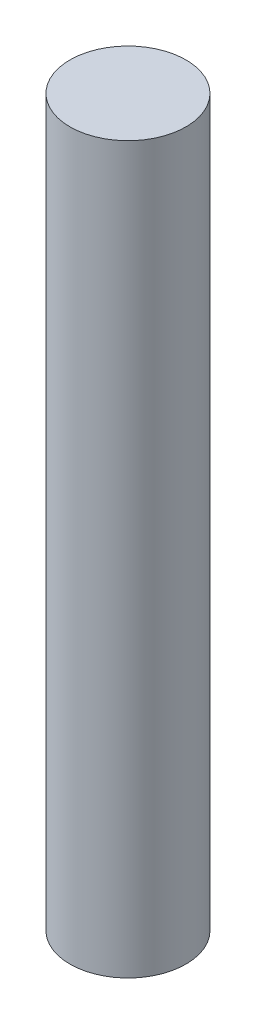
ISO-10303-21;
HEADER;
FILE_DESCRIPTION(('STEP AP214'),'2;1');
FILE_NAME('part.step','',(''),(''),'','','');
FILE_SCHEMA(('AUTOMOTIVE_DESIGN { 1 0 10303 214 1 1 1 1 }'));
ENDSEC;
DATA;
#1=APPLICATION_CONTEXT('core data for automotive mechanical design processes');
#2=APPLICATION_PROTOCOL_DEFINITION('international standard','automotive_design',2000,#1);
#3=PRODUCT_CONTEXT('',#1,'mechanical');
#4=PRODUCT('Part','Part','',(#3));
#5=PRODUCT_RELATED_PRODUCT_CATEGORY('part','',(#4));
#6=PRODUCT_DEFINITION_FORMATION('','',#4);
#7=PRODUCT_DEFINITION_CONTEXT('part definition',#1,'design');
#8=PRODUCT_DEFINITION('design','',#6,#7);
#9=PRODUCT_DEFINITION_SHAPE('','',#8);
#10=(LENGTH_UNIT() NAMED_UNIT(*) SI_UNIT(.MILLI.,.METRE.));
#11=(NAMED_UNIT(*) PLANE_ANGLE_UNIT() SI_UNIT($,.RADIAN.));
#12=(NAMED_UNIT(*) SI_UNIT($,.STERADIAN.) SOLID_ANGLE_UNIT());
#13=UNCERTAINTY_MEASURE_WITH_UNIT(LENGTH_MEASURE(1.E-05),#10,'distance_accuracy_value','');
#14=(GEOMETRIC_REPRESENTATION_CONTEXT(3) GLOBAL_UNCERTAINTY_ASSIGNED_CONTEXT((#13)) GLOBAL_UNIT_ASSIGNED_CONTEXT((#10,
#11,#12)) REPRESENTATION_CONTEXT('',''));
#15=CARTESIAN_POINT('',(0.,0.,0.));
#16=DIRECTION('',(0.,0.,1.));
#17=DIRECTION('',(1.,0.,0.));
#18=AXIS2_PLACEMENT_3D('',#15,#16,#17);
#19=CARTESIAN_POINT('',(0.,125.,0.));
#20=DIRECTION('',(0.,-1.,0.));
#21=DIRECTION('',(0.,0.,-1.));
#22=AXIS2_PLACEMENT_3D('',#19,#20,#21);
#23=CYLINDRICAL_SURFACE('',#22,10.);
#24=CARTESIAN_POINT('',(0.,125.,0.));
#25=DIRECTION('',(0.,1.,0.));
#26=DIRECTION('',(0.,0.,1.));
#27=AXIS2_PLACEMENT_3D('',#24,#25,#26);
#28=CIRCLE('',#27,10.);
#29=CARTESIAN_POINT('',(0.,125.,10.));
#30=VERTEX_POINT('',#29);
#31=EDGE_CURVE('E10',#30,#30,#28,.T.);
#32=ORIENTED_EDGE('',*,*,#31,.F.);
#33=EDGE_LOOP('',(#32));
#34=FACE_BOUND('',#33,.T.);
#35=CARTESIAN_POINT('',(0.,0.,0.));
#36=DIRECTION('',(0.,1.,0.));
#37=DIRECTION('',(0.,0.,1.));
#38=AXIS2_PLACEMENT_3D('',#35,#36,#37);
#39=CIRCLE('',#38,10.);
#40=CARTESIAN_POINT('',(0.,0.,10.));
#41=VERTEX_POINT('',#40);
#42=EDGE_CURVE('E36',#41,#41,#39,.T.);
#43=ORIENTED_EDGE('',*,*,#42,.T.);
#44=EDGE_LOOP('',(#43));
#45=FACE_BOUND('',#44,.T.);
#46=ADVANCED_FACE('F33',(#34,#45),#23,.T.);
#47=CARTESIAN_POINT('',(0.,125.,0.));
#48=DIRECTION('',(0.,1.,0.));
#49=DIRECTION('',(0.,0.,1.));
#50=AXIS2_PLACEMENT_3D('',#47,#48,#49);
#51=PLANE('',#50);
#52=ORIENTED_EDGE('',*,*,#31,.T.);
#53=EDGE_LOOP('',(#52));
#54=FACE_BOUND('',#53,.T.);
#55=ADVANCED_FACE('F48',(#54),#51,.T.);
#56=CARTESIAN_POINT('',(0.,0.,0.));
#57=DIRECTION('',(0.,1.,0.));
#58=DIRECTION('',(0.,0.,1.));
#59=AXIS2_PLACEMENT_3D('',#56,#57,#58);
#60=PLANE('',#59);
#61=ORIENTED_EDGE('',*,*,#42,.F.);
#62=EDGE_LOOP('',(#61));
#63=FACE_BOUND('',#62,.T.);
#64=ADVANCED_FACE('F46',(#63),#60,.F.);
#65=CLOSED_SHELL('',(#46,#55,#64));
#66=MANIFOLD_SOLID_BREP('B2',#65);
#67=ADVANCED_BREP_SHAPE_REPRESENTATION('',(#18,#66),#14);
#68=SHAPE_DEFINITION_REPRESENTATION(#9,#67);
ENDSEC;
END-ISO-10303-21;
